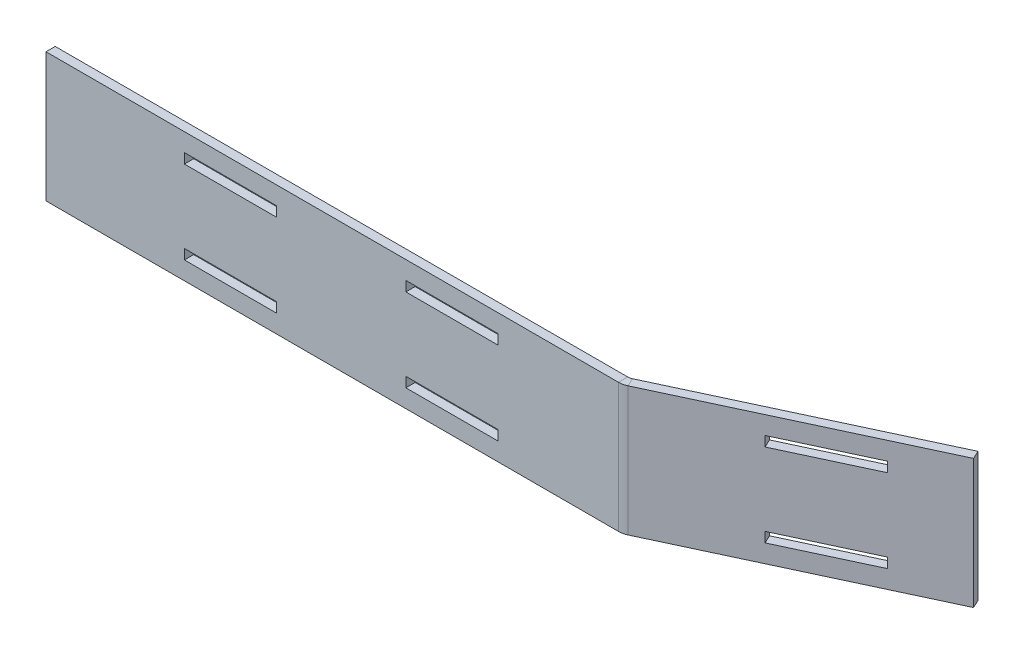
ISO-10303-21;
HEADER;
FILE_DESCRIPTION(('STEP AP214'),'2;1');
FILE_NAME('part.step','',(''),(''),'','','');
FILE_SCHEMA(('AUTOMOTIVE_DESIGN { 1 0 10303 214 1 1 1 1 }'));
ENDSEC;
DATA;
#1=APPLICATION_CONTEXT('core data for automotive mechanical design processes');
#2=APPLICATION_PROTOCOL_DEFINITION('international standard','automotive_design',2000,#1);
#3=PRODUCT_CONTEXT('',#1,'mechanical');
#4=PRODUCT('Part','Part','',(#3));
#5=PRODUCT_RELATED_PRODUCT_CATEGORY('part','',(#4));
#6=PRODUCT_DEFINITION_FORMATION('','',#4);
#7=PRODUCT_DEFINITION_CONTEXT('part definition',#1,'design');
#8=PRODUCT_DEFINITION('design','',#6,#7);
#9=PRODUCT_DEFINITION_SHAPE('','',#8);
#10=(LENGTH_UNIT() NAMED_UNIT(*) SI_UNIT(.MILLI.,.METRE.));
#11=(NAMED_UNIT(*) PLANE_ANGLE_UNIT() SI_UNIT($,.RADIAN.));
#12=(NAMED_UNIT(*) SI_UNIT($,.STERADIAN.) SOLID_ANGLE_UNIT());
#13=UNCERTAINTY_MEASURE_WITH_UNIT(LENGTH_MEASURE(1.E-05),#10,'distance_accuracy_value','');
#14=(GEOMETRIC_REPRESENTATION_CONTEXT(3) GLOBAL_UNCERTAINTY_ASSIGNED_CONTEXT((#13)) GLOBAL_UNIT_ASSIGNED_CONTEXT((#10,
#11,#12)) REPRESENTATION_CONTEXT('',''));
#15=CARTESIAN_POINT('',(0.,0.,0.));
#16=DIRECTION('',(0.,0.,1.));
#17=DIRECTION('',(1.,0.,0.));
#18=AXIS2_PLACEMENT_3D('',#15,#16,#17);
#19=CARTESIAN_POINT('',(198.332218755721,44.45,-0.297472776158614));
#20=DIRECTION('',(0.,1.,0.));
#21=DIRECTION('',(0.,0.,1.));
#22=AXIS2_PLACEMENT_3D('',#19,#20,#21);
#23=PLANE('',#22);
#24=DIRECTION('',(0.422618261740702,0.,0.906307787036649));
#25=VECTOR('',#24,1.);
#26=CARTESIAN_POINT('',(198.332218755721,44.45,-0.297472776158614));
#27=LINE('',#26,#25);
#28=CARTESIAN_POINT('',(198.332218755721,44.45,-0.297472776158614));
#29=VERTEX_POINT('',#28);
#30=CARTESIAN_POINT('',(199.674031736748,44.45,2.58005444768275));
#31=VERTEX_POINT('',#30);
#32=EDGE_CURVE('E11',#29,#31,#27,.T.);
#33=ORIENTED_EDGE('',*,*,#32,.F.);
#34=CARTESIAN_POINT('',(196.990405774695,44.45,-3.17499999999999));
#35=DIRECTION('',(0.,-1.,0.));
#36=DIRECTION('',(0.,0.,-1.));
#37=AXIS2_PLACEMENT_3D('',#34,#35,#36);
#38=CIRCLE('',#37,3.175);
#39=CARTESIAN_POINT('',(196.990405774695,44.45,0.));
#40=VERTEX_POINT('',#39);
#41=EDGE_CURVE('E490',#40,#29,#38,.F.);
#42=ORIENTED_EDGE('',*,*,#41,.F.);
#43=DIRECTION('',(0.,0.,-1.));
#44=VECTOR('',#43,1.);
#45=CARTESIAN_POINT('',(196.990405774695,44.45,3.17500000000001));
#46=LINE('',#45,#44);
#47=CARTESIAN_POINT('',(196.990405774695,44.45,3.17500000000001));
#48=VERTEX_POINT('',#47);
#49=EDGE_CURVE('E53',#48,#40,#46,.T.);
#50=ORIENTED_EDGE('',*,*,#49,.F.);
#51=CARTESIAN_POINT('',(196.990405774695,44.45,-3.17499999999999));
#52=DIRECTION('',(0.,1.,0.));
#53=DIRECTION('',(1.,0.,0.));
#54=AXIS2_PLACEMENT_3D('',#51,#52,#53);
#55=CIRCLE('',#54,6.35);
#56=EDGE_CURVE('E505',#48,#31,#55,.T.);
#57=ORIENTED_EDGE('',*,*,#56,.T.);
#58=EDGE_LOOP('',(#33,#42,#50,#57));
#59=FACE_BOUND('',#58,.T.);
#60=ADVANCED_FACE('F46',(#59),#23,.T.);
#61=CARTESIAN_POINT('',(196.990405774695,44.45,3.17500000000001));
#62=DIRECTION('',(0.,1.,0.));
#63=DIRECTION('',(0.,0.,1.));
#64=AXIS2_PLACEMENT_3D('',#61,#62,#63);
#65=PLANE('',#64);
#66=DIRECTION('',(0.906307787036649,0.,-0.422618261740701));
#67=VECTOR('',#66,1.);
#68=CARTESIAN_POINT('',(197.694286328586,44.45,0.));
#69=LINE('',#68,#67);
#70=CARTESIAN_POINT('',(279.4,44.45,-38.1));
#71=VERTEX_POINT('',#70);
#72=EDGE_CURVE('E487',#29,#71,#69,.T.);
#73=ORIENTED_EDGE('',*,*,#72,.F.);
#74=ORIENTED_EDGE('',*,*,#32,.T.);
#75=DIRECTION('',(0.906307787036649,0.,-0.422618261740701));
#76=VECTOR('',#75,1.);
#77=CARTESIAN_POINT('',(199.036099309613,44.45,2.87752722384136));
#78=LINE('',#77,#76);
#79=CARTESIAN_POINT('',(280.741812981027,44.45,-35.2224727761587));
#80=VERTEX_POINT('',#79);
#81=EDGE_CURVE('E481',#31,#80,#78,.T.);
#82=ORIENTED_EDGE('',*,*,#81,.T.);
#83=DIRECTION('',(0.422618261740711,0.,0.906307787036644));
#84=VECTOR('',#83,1.);
#85=CARTESIAN_POINT('',(279.4,44.45,-38.1));
#86=LINE('',#85,#84);
#87=EDGE_CURVE('E483',#71,#80,#86,.T.);
#88=ORIENTED_EDGE('',*,*,#87,.F.);
#89=EDGE_LOOP('',(#73,#74,#82,#88));
#90=FACE_BOUND('',#89,.T.);
#91=ADVANCED_FACE('F592',(#90),#65,.T.);
#92=CARTESIAN_POINT('',(196.990405774695,0.,0.));
#93=DIRECTION('',(0.,-1.,0.));
#94=DIRECTION('',(0.,0.,-1.));
#95=AXIS2_PLACEMENT_3D('',#92,#93,#94);
#96=PLANE('',#95);
#97=DIRECTION('',(0.,0.,1.));
#98=VECTOR('',#97,1.);
#99=CARTESIAN_POINT('',(196.990405774695,0.,0.));
#100=LINE('',#99,#98);
#101=CARTESIAN_POINT('',(196.990405774695,0.,0.));
#102=VERTEX_POINT('',#101);
#103=CARTESIAN_POINT('',(196.990405774695,0.,3.17500000000001));
#104=VERTEX_POINT('',#103);
#105=EDGE_CURVE('E556',#102,#104,#100,.T.);
#106=ORIENTED_EDGE('',*,*,#105,.F.);
#107=CARTESIAN_POINT('',(196.990405774695,0.,-3.17499999999999));
#108=DIRECTION('',(0.,-1.,0.));
#109=DIRECTION('',(0.,0.,-1.));
#110=AXIS2_PLACEMENT_3D('',#107,#108,#109);
#111=CIRCLE('',#110,3.175);
#112=CARTESIAN_POINT('',(198.332218755721,0.,-0.297472776158614));
#113=VERTEX_POINT('',#112);
#114=EDGE_CURVE('E517',#102,#113,#111,.F.);
#115=ORIENTED_EDGE('',*,*,#114,.T.);
#116=DIRECTION('',(-0.422618261740702,0.,-0.906307787036649));
#117=VECTOR('',#116,1.);
#118=CARTESIAN_POINT('',(199.674031736748,0.,2.58005444768275));
#119=LINE('',#118,#117);
#120=CARTESIAN_POINT('',(199.674031736748,0.,2.58005444768275));
#121=VERTEX_POINT('',#120);
#122=EDGE_CURVE('E554',#121,#113,#119,.T.);
#123=ORIENTED_EDGE('',*,*,#122,.F.);
#124=CARTESIAN_POINT('',(196.990405774695,0.,-3.17499999999999));
#125=DIRECTION('',(0.,1.,0.));
#126=DIRECTION('',(1.,0.,0.));
#127=AXIS2_PLACEMENT_3D('',#124,#125,#126);
#128=CIRCLE('',#127,6.35);
#129=EDGE_CURVE('E484',#104,#121,#128,.T.);
#130=ORIENTED_EDGE('',*,*,#129,.F.);
#131=EDGE_LOOP('',(#106,#115,#123,#130));
#132=FACE_BOUND('',#131,.T.);
#133=ADVANCED_FACE('F598',(#132),#96,.T.);
#134=CARTESIAN_POINT('',(199.674031736748,0.,2.58005444768275));
#135=DIRECTION('',(0.,-1.,0.));
#136=DIRECTION('',(0.,0.,-1.));
#137=AXIS2_PLACEMENT_3D('',#134,#135,#136);
#138=PLANE('',#137);
#139=DIRECTION('',(1.,0.,0.));
#140=VECTOR('',#139,1.);
#141=CARTESIAN_POINT('',(0.,0.,0.));
#142=LINE('',#141,#140);
#143=CARTESIAN_POINT('',(0.,0.,0.));
#144=VERTEX_POINT('',#143);
#145=EDGE_CURVE('E520',#144,#102,#142,.T.);
#146=ORIENTED_EDGE('',*,*,#145,.T.);
#147=ORIENTED_EDGE('',*,*,#105,.T.);
#148=DIRECTION('',(1.,0.,0.));
#149=VECTOR('',#148,1.);
#150=CARTESIAN_POINT('',(0.,0.,3.175));
#151=LINE('',#150,#149);
#152=CARTESIAN_POINT('',(0.,0.,3.175));
#153=VERTEX_POINT('',#152);
#154=EDGE_CURVE('E527',#153,#104,#151,.T.);
#155=ORIENTED_EDGE('',*,*,#154,.F.);
#156=DIRECTION('',(0.,0.,-1.));
#157=VECTOR('',#156,1.);
#158=CARTESIAN_POINT('',(0.,0.,3.175));
#159=LINE('',#158,#157);
#160=EDGE_CURVE('E524',#153,#144,#159,.T.);
#161=ORIENTED_EDGE('',*,*,#160,.T.);
#162=EDGE_LOOP('',(#146,#147,#155,#161));
#163=FACE_BOUND('',#162,.T.);
#164=ADVANCED_FACE('F600',(#163),#138,.T.);
#165=CARTESIAN_POINT('',(199.036099309613,44.45,2.87752722384136));
#166=DIRECTION('',(-0.422618261740701,0.,-0.906307787036649));
#167=DIRECTION('',(-0.906307787036649,0.,0.422618261740701));
#168=AXIS2_PLACEMENT_3D('',#165,#166,#167);
#169=PLANE('',#168);
#170=DIRECTION('',(-0.906307787036649,0.,0.422618261740701));
#171=VECTOR('',#170,1.);
#172=CARTESIAN_POINT('',(199.036099309613,34.798,2.87752722384136));
#173=LINE('',#172,#171);
#174=CARTESIAN_POINT('',(260.599122414137,34.798,-25.8297819089716));
#175=VERTEX_POINT('',#174);
#176=CARTESIAN_POINT('',(231.823850175724,34.798,-12.4116520987043));
#177=VERTEX_POINT('',#176);
#178=EDGE_CURVE('E329',#175,#177,#173,.T.);
#179=ORIENTED_EDGE('',*,*,#178,.T.);
#180=DIRECTION('',(0.,1.,0.));
#181=VECTOR('',#180,1.);
#182=CARTESIAN_POINT('',(231.823850175724,44.45,-12.4116520987043));
#183=LINE('',#182,#181);
#184=CARTESIAN_POINT('',(231.823850175724,38.227,-12.4116520987043));
#185=VERTEX_POINT('',#184);
#186=EDGE_CURVE('E332',#177,#185,#183,.T.);
#187=ORIENTED_EDGE('',*,*,#186,.T.);
#188=DIRECTION('',(0.906307787036649,0.,-0.422618261740701));
#189=VECTOR('',#188,1.);
#190=CARTESIAN_POINT('',(199.036099309613,38.227,2.87752722384136));
#191=LINE('',#190,#189);
#192=CARTESIAN_POINT('',(260.599122414137,38.227,-25.8297819089716));
#193=VERTEX_POINT('',#192);
#194=EDGE_CURVE('E326',#185,#193,#191,.T.);
#195=ORIENTED_EDGE('',*,*,#194,.T.);
#196=DIRECTION('',(0.,-1.,0.));
#197=VECTOR('',#196,1.);
#198=CARTESIAN_POINT('',(260.599122414137,44.4500000000001,-25.8297819089716));
#199=LINE('',#198,#197);
#200=EDGE_CURVE('E270',#193,#175,#199,.T.);
#201=ORIENTED_EDGE('',*,*,#200,.T.);
#202=EDGE_LOOP('',(#179,#187,#195,#201));
#203=FACE_BOUND('',#202,.T.);
#204=DIRECTION('',(0.906307787036649,0.,-0.422618261740701));
#205=VECTOR('',#204,1.);
#206=CARTESIAN_POINT('',(199.036099309613,9.652,2.87752722384136));
#207=LINE('',#206,#205);
#208=CARTESIAN_POINT('',(231.823850175724,9.652,-12.4116520987044));
#209=VERTEX_POINT('',#208);
#210=CARTESIAN_POINT('',(260.599122414137,9.652,-25.8297819089716));
#211=VERTEX_POINT('',#210);
#212=EDGE_CURVE('E320',#209,#211,#207,.T.);
#213=ORIENTED_EDGE('',*,*,#212,.T.);
#214=DIRECTION('',(0.,-1.,0.));
#215=VECTOR('',#214,1.);
#216=CARTESIAN_POINT('',(260.599122414137,44.4499999999999,-25.8297819089716));
#217=LINE('',#216,#215);
#218=CARTESIAN_POINT('',(260.599122414137,6.223,-25.8297819089716));
#219=VERTEX_POINT('',#218);
#220=EDGE_CURVE('E323',#211,#219,#217,.T.);
#221=ORIENTED_EDGE('',*,*,#220,.T.);
#222=DIRECTION('',(-0.906307787036649,0.,0.422618261740701));
#223=VECTOR('',#222,1.);
#224=CARTESIAN_POINT('',(199.036099309613,6.223,2.87752722384136));
#225=LINE('',#224,#223);
#226=CARTESIAN_POINT('',(231.823850175724,6.223,-12.4116520987043));
#227=VERTEX_POINT('',#226);
#228=EDGE_CURVE('E294',#219,#227,#225,.T.);
#229=ORIENTED_EDGE('',*,*,#228,.T.);
#230=DIRECTION('',(0.,1.,0.));
#231=VECTOR('',#230,1.);
#232=CARTESIAN_POINT('',(231.823850175724,44.45,-12.4116520987043));
#233=LINE('',#232,#231);
#234=EDGE_CURVE('E317',#227,#209,#233,.T.);
#235=ORIENTED_EDGE('',*,*,#234,.T.);
#236=EDGE_LOOP('',(#213,#221,#229,#235));
#237=FACE_BOUND('',#236,.T.);
#238=DIRECTION('',(0.906307787036649,0.,-0.422618261740701));
#239=VECTOR('',#238,1.);
#240=CARTESIAN_POINT('',(199.036099309613,0.,2.87752722384136));
#241=LINE('',#240,#239);
#242=CARTESIAN_POINT('',(280.741812981027,0.,-35.2224727761587));
#243=VERTEX_POINT('',#242);
#244=EDGE_CURVE('E474',#121,#243,#241,.T.);
#245=ORIENTED_EDGE('',*,*,#244,.T.);
#246=DIRECTION('',(0.,-1.,0.));
#247=VECTOR('',#246,1.);
#248=CARTESIAN_POINT('',(280.741812981027,44.45,-35.2224727761587));
#249=LINE('',#248,#247);
#250=EDGE_CURVE('E552',#80,#243,#249,.T.);
#251=ORIENTED_EDGE('',*,*,#250,.F.);
#252=ORIENTED_EDGE('',*,*,#81,.F.);
#253=DIRECTION('',(0.,-1.,0.));
#254=VECTOR('',#253,1.);
#255=CARTESIAN_POINT('',(199.674031736748,44.45,2.58005444768275));
#256=LINE('',#255,#254);
#257=EDGE_CURVE('E508',#31,#121,#256,.T.);
#258=ORIENTED_EDGE('',*,*,#257,.T.);
#259=EDGE_LOOP('',(#245,#251,#252,#258));
#260=FACE_BOUND('',#259,.T.);
#261=ADVANCED_FACE('F588',(#203,#237,#260),#169,.F.);
#262=CARTESIAN_POINT('',(279.4,44.45,-38.1));
#263=DIRECTION('',(0.906307787036644,0.,-0.422618261740711));
#264=DIRECTION('',(-0.422618261740711,0.,-0.906307787036645));
#265=AXIS2_PLACEMENT_3D('',#262,#263,#264);
#266=PLANE('',#265);
#267=DIRECTION('',(0.422618261740711,0.,0.906307787036644));
#268=VECTOR('',#267,1.);
#269=CARTESIAN_POINT('',(279.4,0.,-38.1));
#270=LINE('',#269,#268);
#271=CARTESIAN_POINT('',(279.4,0.,-38.1));
#272=VERTEX_POINT('',#271);
#273=EDGE_CURVE('E511',#272,#243,#270,.T.);
#274=ORIENTED_EDGE('',*,*,#273,.F.);
#275=DIRECTION('',(0.,-1.,0.));
#276=VECTOR('',#275,1.);
#277=CARTESIAN_POINT('',(279.4,44.45,-38.1));
#278=LINE('',#277,#276);
#279=EDGE_CURVE('E550',#71,#272,#278,.T.);
#280=ORIENTED_EDGE('',*,*,#279,.F.);
#281=ORIENTED_EDGE('',*,*,#87,.T.);
#282=ORIENTED_EDGE('',*,*,#250,.T.);
#283=EDGE_LOOP('',(#274,#280,#281,#282));
#284=FACE_BOUND('',#283,.T.);
#285=ADVANCED_FACE('F608',(#284),#266,.T.);
#286=CARTESIAN_POINT('',(197.694286328586,44.45,0.));
#287=DIRECTION('',(-0.422618261740701,0.,-0.906307787036649));
#288=DIRECTION('',(-0.906307787036649,0.,0.422618261740701));
#289=AXIS2_PLACEMENT_3D('',#286,#287,#288);
#290=PLANE('',#289);
#291=DIRECTION('',(0.,1.,0.));
#292=VECTOR('',#291,1.);
#293=CARTESIAN_POINT('',(230.482037194697,38.227,-15.2891793225457));
#294=LINE('',#293,#292);
#295=CARTESIAN_POINT('',(230.482037194697,34.798,-15.2891793225457));
#296=VERTEX_POINT('',#295);
#297=CARTESIAN_POINT('',(230.482037194697,38.227,-15.2891793225457));
#298=VERTEX_POINT('',#297);
#299=EDGE_CURVE('E282',#296,#298,#294,.T.);
#300=ORIENTED_EDGE('',*,*,#299,.F.);
#301=DIRECTION('',(-0.906307787036649,0.,0.422618261740701));
#302=VECTOR('',#301,1.);
#303=CARTESIAN_POINT('',(259.257309433111,34.798,-28.7073091328129));
#304=LINE('',#303,#302);
#305=CARTESIAN_POINT('',(259.257309433111,34.798,-28.7073091328129));
#306=VERTEX_POINT('',#305);
#307=EDGE_CURVE('E287',#306,#296,#304,.T.);
#308=ORIENTED_EDGE('',*,*,#307,.F.);
#309=DIRECTION('',(0.,-1.,0.));
#310=VECTOR('',#309,1.);
#311=CARTESIAN_POINT('',(259.257309433111,38.227,-28.7073091328129));
#312=LINE('',#311,#310);
#313=CARTESIAN_POINT('',(259.257309433111,38.227,-28.7073091328129));
#314=VERTEX_POINT('',#313);
#315=EDGE_CURVE('E267',#314,#306,#312,.T.);
#316=ORIENTED_EDGE('',*,*,#315,.F.);
#317=DIRECTION('',(0.906307787036649,0.,-0.422618261740701));
#318=VECTOR('',#317,1.);
#319=CARTESIAN_POINT('',(259.257309433111,38.227,-28.7073091328129));
#320=LINE('',#319,#318);
#321=EDGE_CURVE('E277',#298,#314,#320,.T.);
#322=ORIENTED_EDGE('',*,*,#321,.F.);
#323=EDGE_LOOP('',(#300,#308,#316,#322));
#324=FACE_BOUND('',#323,.T.);
#325=DIRECTION('',(0.,-1.,0.));
#326=VECTOR('',#325,1.);
#327=CARTESIAN_POINT('',(259.257309433111,6.223,-28.7073091328129));
#328=LINE('',#327,#326);
#329=CARTESIAN_POINT('',(259.257309433111,9.652,-28.7073091328129));
#330=VERTEX_POINT('',#329);
#331=CARTESIAN_POINT('',(259.25730943311,6.223,-28.7073091328129));
#332=VERTEX_POINT('',#331);
#333=EDGE_CURVE('E313',#330,#332,#328,.T.);
#334=ORIENTED_EDGE('',*,*,#333,.F.);
#335=DIRECTION('',(0.906307787036649,0.,-0.422618261740701));
#336=VECTOR('',#335,1.);
#337=CARTESIAN_POINT('',(259.257309433111,9.652,-28.7073091328129));
#338=LINE('',#337,#336);
#339=CARTESIAN_POINT('',(230.482037194697,9.652,-15.2891793225457));
#340=VERTEX_POINT('',#339);
#341=EDGE_CURVE('E300',#340,#330,#338,.T.);
#342=ORIENTED_EDGE('',*,*,#341,.F.);
#343=DIRECTION('',(0.,1.,0.));
#344=VECTOR('',#343,1.);
#345=CARTESIAN_POINT('',(230.482037194697,6.223,-15.2891793225457));
#346=LINE('',#345,#344);
#347=CARTESIAN_POINT('',(230.482037194697,6.223,-15.2891793225457));
#348=VERTEX_POINT('',#347);
#349=EDGE_CURVE('E308',#348,#340,#346,.T.);
#350=ORIENTED_EDGE('',*,*,#349,.F.);
#351=DIRECTION('',(-0.906307787036649,0.,0.422618261740701));
#352=VECTOR('',#351,1.);
#353=CARTESIAN_POINT('',(259.257309433111,6.223,-28.7073091328129));
#354=LINE('',#353,#352);
#355=EDGE_CURVE('E311',#332,#348,#354,.T.);
#356=ORIENTED_EDGE('',*,*,#355,.F.);
#357=EDGE_LOOP('',(#334,#342,#350,#356));
#358=FACE_BOUND('',#357,.T.);
#359=DIRECTION('',(0.906307787036649,0.,-0.422618261740701));
#360=VECTOR('',#359,1.);
#361=CARTESIAN_POINT('',(197.694286328586,0.,0.));
#362=LINE('',#361,#360);
#363=EDGE_CURVE('E514',#113,#272,#362,.T.);
#364=ORIENTED_EDGE('',*,*,#363,.F.);
#365=DIRECTION('',(0.,-1.,0.));
#366=VECTOR('',#365,1.);
#367=CARTESIAN_POINT('',(198.332218755721,44.45,-0.297472776158614));
#368=LINE('',#367,#366);
#369=EDGE_CURVE('E547',#29,#113,#368,.T.);
#370=ORIENTED_EDGE('',*,*,#369,.F.);
#371=ORIENTED_EDGE('',*,*,#72,.T.);
#372=ORIENTED_EDGE('',*,*,#279,.T.);
#373=EDGE_LOOP('',(#364,#370,#371,#372));
#374=FACE_BOUND('',#373,.T.);
#375=ADVANCED_FACE('F284',(#324,#358,#374),#290,.T.);
#376=CARTESIAN_POINT('',(196.990405774695,44.45,-3.17499999999999));
#377=DIRECTION('',(0.,-1.,0.));
#378=DIRECTION('',(0.,0.,-1.));
#379=AXIS2_PLACEMENT_3D('',#376,#377,#378);
#380=CYLINDRICAL_SURFACE('',#379,3.175);
#381=ORIENTED_EDGE('',*,*,#114,.F.);
#382=DIRECTION('',(0.,-1.,0.));
#383=VECTOR('',#382,1.);
#384=CARTESIAN_POINT('',(196.990405774695,44.45,0.));
#385=LINE('',#384,#383);
#386=EDGE_CURVE('E544',#40,#102,#385,.T.);
#387=ORIENTED_EDGE('',*,*,#386,.F.);
#388=ORIENTED_EDGE('',*,*,#41,.T.);
#389=ORIENTED_EDGE('',*,*,#369,.T.);
#390=EDGE_LOOP('',(#381,#387,#388,#389));
#391=FACE_BOUND('',#390,.T.);
#392=ADVANCED_FACE('F568',(#391),#380,.F.);
#393=CARTESIAN_POINT('',(0.,44.45,0.));
#394=DIRECTION('',(0.,0.,-1.));
#395=DIRECTION('',(-1.,0.,0.));
#396=AXIS2_PLACEMENT_3D('',#393,#394,#395);
#397=PLANE('',#396);
#398=DIRECTION('',(-1.,0.,0.));
#399=VECTOR('',#398,1.);
#400=CARTESIAN_POINT('',(47.625,6.22300000000002,0.));
#401=LINE('',#400,#399);
#402=CARTESIAN_POINT('',(79.375,6.22300000000002,0.));
#403=VERTEX_POINT('',#402);
#404=CARTESIAN_POINT('',(47.625,6.22300000000002,0.));
#405=VERTEX_POINT('',#404);
#406=EDGE_CURVE('E380',#403,#405,#401,.T.);
#407=ORIENTED_EDGE('',*,*,#406,.F.);
#408=DIRECTION('',(0.,-1.,0.));
#409=VECTOR('',#408,1.);
#410=CARTESIAN_POINT('',(79.375,6.22300000000002,0.));
#411=LINE('',#410,#409);
#412=CARTESIAN_POINT('',(79.375,9.65200000000002,0.));
#413=VERTEX_POINT('',#412);
#414=EDGE_CURVE('E415',#413,#403,#411,.T.);
#415=ORIENTED_EDGE('',*,*,#414,.F.);
#416=DIRECTION('',(1.,0.,0.));
#417=VECTOR('',#416,1.);
#418=CARTESIAN_POINT('',(47.625,9.65200000000003,0.));
#419=LINE('',#418,#417);
#420=CARTESIAN_POINT('',(47.625,9.65200000000003,0.));
#421=VERTEX_POINT('',#420);
#422=EDGE_CURVE('E419',#421,#413,#419,.T.);
#423=ORIENTED_EDGE('',*,*,#422,.F.);
#424=DIRECTION('',(0.,1.,0.));
#425=VECTOR('',#424,1.);
#426=CARTESIAN_POINT('',(47.625,6.22300000000002,0.));
#427=LINE('',#426,#425);
#428=EDGE_CURVE('E424',#405,#421,#427,.T.);
#429=ORIENTED_EDGE('',*,*,#428,.F.);
#430=EDGE_LOOP('',(#407,#415,#423,#429));
#431=FACE_BOUND('',#430,.T.);
#432=DIRECTION('',(-1.,0.,0.));
#433=VECTOR('',#432,1.);
#434=CARTESIAN_POINT('',(123.825,6.22300000000002,0.));
#435=LINE('',#434,#433);
#436=CARTESIAN_POINT('',(155.575,6.22300000000002,0.));
#437=VERTEX_POINT('',#436);
#438=CARTESIAN_POINT('',(123.825,6.22300000000002,0.));
#439=VERTEX_POINT('',#438);
#440=EDGE_CURVE('E346',#437,#439,#435,.T.);
#441=ORIENTED_EDGE('',*,*,#440,.F.);
#442=DIRECTION('',(0.,-1.,0.));
#443=VECTOR('',#442,1.);
#444=CARTESIAN_POINT('',(155.575,6.22300000000002,0.));
#445=LINE('',#444,#443);
#446=CARTESIAN_POINT('',(155.575,9.65200000000001,0.));
#447=VERTEX_POINT('',#446);
#448=EDGE_CURVE('E381',#447,#437,#445,.T.);
#449=ORIENTED_EDGE('',*,*,#448,.F.);
#450=DIRECTION('',(1.,0.,0.));
#451=VECTOR('',#450,1.);
#452=CARTESIAN_POINT('',(123.825,9.65200000000001,0.));
#453=LINE('',#452,#451);
#454=CARTESIAN_POINT('',(123.825,9.65200000000001,0.));
#455=VERTEX_POINT('',#454);
#456=EDGE_CURVE('E384',#455,#447,#453,.T.);
#457=ORIENTED_EDGE('',*,*,#456,.F.);
#458=DIRECTION('',(0.,1.,0.));
#459=VECTOR('',#458,1.);
#460=CARTESIAN_POINT('',(123.825,6.22300000000002,0.));
#461=LINE('',#460,#459);
#462=EDGE_CURVE('E388',#439,#455,#461,.T.);
#463=ORIENTED_EDGE('',*,*,#462,.F.);
#464=EDGE_LOOP('',(#441,#449,#457,#463));
#465=FACE_BOUND('',#464,.T.);
#466=DIRECTION('',(0.,1.,0.));
#467=VECTOR('',#466,1.);
#468=CARTESIAN_POINT('',(123.825,38.227,0.));
#469=LINE('',#468,#467);
#470=CARTESIAN_POINT('',(123.825,34.798,0.));
#471=VERTEX_POINT('',#470);
#472=CARTESIAN_POINT('',(123.825,38.227,0.));
#473=VERTEX_POINT('',#472);
#474=EDGE_CURVE('E357',#471,#473,#469,.T.);
#475=ORIENTED_EDGE('',*,*,#474,.F.);
#476=DIRECTION('',(-1.,0.,0.));
#477=VECTOR('',#476,1.);
#478=CARTESIAN_POINT('',(123.825,34.798,0.));
#479=LINE('',#478,#477);
#480=CARTESIAN_POINT('',(155.575,34.798,0.));
#481=VERTEX_POINT('',#480);
#482=EDGE_CURVE('E347',#481,#471,#479,.T.);
#483=ORIENTED_EDGE('',*,*,#482,.F.);
#484=DIRECTION('',(0.,-1.,0.));
#485=VECTOR('',#484,1.);
#486=CARTESIAN_POINT('',(155.575,38.227,0.));
#487=LINE('',#486,#485);
#488=CARTESIAN_POINT('',(155.575,38.227,0.));
#489=VERTEX_POINT('',#488);
#490=EDGE_CURVE('E350',#489,#481,#487,.T.);
#491=ORIENTED_EDGE('',*,*,#490,.F.);
#492=DIRECTION('',(1.,0.,0.));
#493=VECTOR('',#492,1.);
#494=CARTESIAN_POINT('',(123.825,38.227,0.));
#495=LINE('',#494,#493);
#496=EDGE_CURVE('E354',#473,#489,#495,.T.);
#497=ORIENTED_EDGE('',*,*,#496,.F.);
#498=EDGE_LOOP('',(#475,#483,#491,#497));
#499=FACE_BOUND('',#498,.T.);
#500=DIRECTION('',(0.,1.,0.));
#501=VECTOR('',#500,1.);
#502=CARTESIAN_POINT('',(47.625,38.227,0.));
#503=LINE('',#502,#501);
#504=CARTESIAN_POINT('',(47.625,34.798,0.));
#505=VERTEX_POINT('',#504);
#506=CARTESIAN_POINT('',(47.625,38.227,0.));
#507=VERTEX_POINT('',#506);
#508=EDGE_CURVE('E359',#505,#507,#503,.T.);
#509=ORIENTED_EDGE('',*,*,#508,.F.);
#510=DIRECTION('',(-1.,0.,0.));
#511=VECTOR('',#510,1.);
#512=CARTESIAN_POINT('',(47.625,34.798,0.));
#513=LINE('',#512,#511);
#514=CARTESIAN_POINT('',(79.375,34.798,0.));
#515=VERTEX_POINT('',#514);
#516=EDGE_CURVE('E449',#515,#505,#513,.T.);
#517=ORIENTED_EDGE('',*,*,#516,.F.);
#518=DIRECTION('',(0.,-1.,0.));
#519=VECTOR('',#518,1.);
#520=CARTESIAN_POINT('',(79.375,38.227,0.));
#521=LINE('',#520,#519);
#522=CARTESIAN_POINT('',(79.375,38.227,0.));
#523=VERTEX_POINT('',#522);
#524=EDGE_CURVE('E465',#523,#515,#521,.T.);
#525=ORIENTED_EDGE('',*,*,#524,.F.);
#526=DIRECTION('',(1.,0.,0.));
#527=VECTOR('',#526,1.);
#528=CARTESIAN_POINT('',(47.625,38.227,0.));
#529=LINE('',#528,#527);
#530=EDGE_CURVE('E462',#507,#523,#529,.T.);
#531=ORIENTED_EDGE('',*,*,#530,.F.);
#532=EDGE_LOOP('',(#509,#517,#525,#531));
#533=FACE_BOUND('',#532,.T.);
#534=ORIENTED_EDGE('',*,*,#145,.F.);
#535=DIRECTION('',(0.,-1.,0.));
#536=VECTOR('',#535,1.);
#537=CARTESIAN_POINT('',(0.,44.45,0.));
#538=LINE('',#537,#536);
#539=CARTESIAN_POINT('',(0.,44.45,0.));
#540=VERTEX_POINT('',#539);
#541=EDGE_CURVE('E541',#540,#144,#538,.T.);
#542=ORIENTED_EDGE('',*,*,#541,.F.);
#543=DIRECTION('',(1.,0.,0.));
#544=VECTOR('',#543,1.);
#545=CARTESIAN_POINT('',(0.,44.45,0.));
#546=LINE('',#545,#544);
#547=EDGE_CURVE('E493',#540,#40,#546,.T.);
#548=ORIENTED_EDGE('',*,*,#547,.T.);
#549=ORIENTED_EDGE('',*,*,#386,.T.);
#550=EDGE_LOOP('',(#534,#542,#548,#549));
#551=FACE_BOUND('',#550,.T.);
#552=ADVANCED_FACE('F572',(#431,#465,#499,#533,#551),#397,.T.);
#553=CARTESIAN_POINT('',(0.,44.45,3.175));
#554=DIRECTION('',(-1.,0.,0.));
#555=DIRECTION('',(0.,0.,1.));
#556=AXIS2_PLACEMENT_3D('',#553,#554,#555);
#557=PLANE('',#556);
#558=ORIENTED_EDGE('',*,*,#160,.F.);
#559=DIRECTION('',(0.,-1.,0.));
#560=VECTOR('',#559,1.);
#561=CARTESIAN_POINT('',(0.,44.45,3.175));
#562=LINE('',#561,#560);
#563=CARTESIAN_POINT('',(0.,44.45,3.175));
#564=VERTEX_POINT('',#563);
#565=EDGE_CURVE('E538',#564,#153,#562,.T.);
#566=ORIENTED_EDGE('',*,*,#565,.F.);
#567=DIRECTION('',(0.,0.,-1.));
#568=VECTOR('',#567,1.);
#569=CARTESIAN_POINT('',(0.,44.45,3.175));
#570=LINE('',#569,#568);
#571=EDGE_CURVE('E497',#564,#540,#570,.T.);
#572=ORIENTED_EDGE('',*,*,#571,.T.);
#573=ORIENTED_EDGE('',*,*,#541,.T.);
#574=EDGE_LOOP('',(#558,#566,#572,#573));
#575=FACE_BOUND('',#574,.T.);
#576=ADVANCED_FACE('F575',(#575),#557,.T.);
#577=CARTESIAN_POINT('',(0.,44.45,3.175));
#578=DIRECTION('',(0.,0.,-1.));
#579=DIRECTION('',(-1.,0.,0.));
#580=AXIS2_PLACEMENT_3D('',#577,#578,#579);
#581=PLANE('',#580);
#582=DIRECTION('',(0.,-1.,0.));
#583=VECTOR('',#582,1.);
#584=CARTESIAN_POINT('',(79.375,6.22300000000002,3.17500000000001));
#585=LINE('',#584,#583);
#586=CARTESIAN_POINT('',(79.375,9.65200000000002,3.17500000000001));
#587=VERTEX_POINT('',#586);
#588=CARTESIAN_POINT('',(79.375,6.22300000000002,3.17500000000001));
#589=VERTEX_POINT('',#588);
#590=EDGE_CURVE('E406',#587,#589,#585,.T.);
#591=ORIENTED_EDGE('',*,*,#590,.T.);
#592=DIRECTION('',(-1.,0.,0.));
#593=VECTOR('',#592,1.);
#594=CARTESIAN_POINT('',(47.625,6.22300000000002,3.17500000000001));
#595=LINE('',#594,#593);
#596=CARTESIAN_POINT('',(47.625,6.22300000000002,3.17500000000001));
#597=VERTEX_POINT('',#596);
#598=EDGE_CURVE('E420',#589,#597,#595,.T.);
#599=ORIENTED_EDGE('',*,*,#598,.T.);
#600=DIRECTION('',(0.,1.,0.));
#601=VECTOR('',#600,1.);
#602=CARTESIAN_POINT('',(47.625,6.22300000000002,3.17500000000001));
#603=LINE('',#602,#601);
#604=CARTESIAN_POINT('',(47.625,9.65200000000002,3.175));
#605=VERTEX_POINT('',#604);
#606=EDGE_CURVE('E437',#597,#605,#603,.T.);
#607=ORIENTED_EDGE('',*,*,#606,.T.);
#608=DIRECTION('',(1.,0.,0.));
#609=VECTOR('',#608,1.);
#610=CARTESIAN_POINT('',(47.625,9.65200000000003,3.17500000000001));
#611=LINE('',#610,#609);
#612=EDGE_CURVE('E433',#605,#587,#611,.T.);
#613=ORIENTED_EDGE('',*,*,#612,.T.);
#614=EDGE_LOOP('',(#591,#599,#607,#613));
#615=FACE_BOUND('',#614,.T.);
#616=DIRECTION('',(0.,-1.,0.));
#617=VECTOR('',#616,1.);
#618=CARTESIAN_POINT('',(155.575,6.22300000000002,3.17500000000001));
#619=LINE('',#618,#617);
#620=CARTESIAN_POINT('',(155.575,9.65200000000001,3.17500000000001));
#621=VERTEX_POINT('',#620);
#622=CARTESIAN_POINT('',(155.575,6.22300000000002,3.17500000000001));
#623=VERTEX_POINT('',#622);
#624=EDGE_CURVE('E373',#621,#623,#619,.T.);
#625=ORIENTED_EDGE('',*,*,#624,.T.);
#626=DIRECTION('',(-1.,0.,0.));
#627=VECTOR('',#626,1.);
#628=CARTESIAN_POINT('',(123.825,6.22300000000002,3.17500000000001));
#629=LINE('',#628,#627);
#630=CARTESIAN_POINT('',(123.825,6.22300000000002,3.17500000000001));
#631=VERTEX_POINT('',#630);
#632=EDGE_CURVE('E385',#623,#631,#629,.T.);
#633=ORIENTED_EDGE('',*,*,#632,.T.);
#634=DIRECTION('',(0.,1.,0.));
#635=VECTOR('',#634,1.);
#636=CARTESIAN_POINT('',(123.825,6.22300000000002,3.17500000000001));
#637=LINE('',#636,#635);
#638=CARTESIAN_POINT('',(123.825,9.65200000000001,3.175));
#639=VERTEX_POINT('',#638);
#640=EDGE_CURVE('E397',#631,#639,#637,.T.);
#641=ORIENTED_EDGE('',*,*,#640,.T.);
#642=DIRECTION('',(1.,0.,0.));
#643=VECTOR('',#642,1.);
#644=CARTESIAN_POINT('',(123.825,9.65200000000001,3.17500000000001));
#645=LINE('',#644,#643);
#646=EDGE_CURVE('E394',#639,#621,#645,.T.);
#647=ORIENTED_EDGE('',*,*,#646,.T.);
#648=EDGE_LOOP('',(#625,#633,#641,#647));
#649=FACE_BOUND('',#648,.T.);
#650=DIRECTION('',(-1.,0.,0.));
#651=VECTOR('',#650,1.);
#652=CARTESIAN_POINT('',(123.825,34.798,3.17500000000001));
#653=LINE('',#652,#651);
#654=CARTESIAN_POINT('',(155.575,34.798,3.17500000000001));
#655=VERTEX_POINT('',#654);
#656=CARTESIAN_POINT('',(123.825,34.798,3.17500000000001));
#657=VERTEX_POINT('',#656);
#658=EDGE_CURVE('E339',#655,#657,#653,.T.);
#659=ORIENTED_EDGE('',*,*,#658,.T.);
#660=DIRECTION('',(0.,1.,0.));
#661=VECTOR('',#660,1.);
#662=CARTESIAN_POINT('',(123.825,38.227,3.17500000000001));
#663=LINE('',#662,#661);
#664=CARTESIAN_POINT('',(123.825,38.227,3.17500000000001));
#665=VERTEX_POINT('',#664);
#666=EDGE_CURVE('E351',#657,#665,#663,.T.);
#667=ORIENTED_EDGE('',*,*,#666,.T.);
#668=DIRECTION('',(1.,0.,0.));
#669=VECTOR('',#668,1.);
#670=CARTESIAN_POINT('',(123.825,38.227,3.17500000000001));
#671=LINE('',#670,#669);
#672=CARTESIAN_POINT('',(155.575,38.227,3.175));
#673=VERTEX_POINT('',#672);
#674=EDGE_CURVE('E365',#665,#673,#671,.T.);
#675=ORIENTED_EDGE('',*,*,#674,.T.);
#676=DIRECTION('',(0.,-1.,0.));
#677=VECTOR('',#676,1.);
#678=CARTESIAN_POINT('',(155.575,38.227,3.17500000000001));
#679=LINE('',#678,#677);
#680=EDGE_CURVE('E362',#673,#655,#679,.T.);
#681=ORIENTED_EDGE('',*,*,#680,.T.);
#682=EDGE_LOOP('',(#659,#667,#675,#681));
#683=FACE_BOUND('',#682,.T.);
#684=DIRECTION('',(-1.,0.,0.));
#685=VECTOR('',#684,1.);
#686=CARTESIAN_POINT('',(47.625,34.798,3.17500000000001));
#687=LINE('',#686,#685);
#688=CARTESIAN_POINT('',(79.375,34.798,3.17500000000001));
#689=VERTEX_POINT('',#688);
#690=CARTESIAN_POINT('',(47.625,34.798,3.17500000000001));
#691=VERTEX_POINT('',#690);
#692=EDGE_CURVE('E455',#689,#691,#687,.T.);
#693=ORIENTED_EDGE('',*,*,#692,.T.);
#694=DIRECTION('',(0.,1.,0.));
#695=VECTOR('',#694,1.);
#696=CARTESIAN_POINT('',(47.625,38.227,3.17500000000001));
#697=LINE('',#696,#695);
#698=CARTESIAN_POINT('',(47.625,38.227,3.17500000000001));
#699=VERTEX_POINT('',#698);
#700=EDGE_CURVE('E444',#691,#699,#697,.T.);
#701=ORIENTED_EDGE('',*,*,#700,.T.);
#702=DIRECTION('',(1.,0.,0.));
#703=VECTOR('',#702,1.);
#704=CARTESIAN_POINT('',(47.625,38.227,3.17500000000001));
#705=LINE('',#704,#703);
#706=CARTESIAN_POINT('',(79.375,38.227,3.175));
#707=VERTEX_POINT('',#706);
#708=EDGE_CURVE('E448',#699,#707,#705,.T.);
#709=ORIENTED_EDGE('',*,*,#708,.T.);
#710=DIRECTION('',(0.,-1.,0.));
#711=VECTOR('',#710,1.);
#712=CARTESIAN_POINT('',(79.375,38.227,3.17500000000001));
#713=LINE('',#712,#711);
#714=EDGE_CURVE('E452',#707,#689,#713,.T.);
#715=ORIENTED_EDGE('',*,*,#714,.T.);
#716=EDGE_LOOP('',(#693,#701,#709,#715));
#717=FACE_BOUND('',#716,.T.);
#718=ORIENTED_EDGE('',*,*,#154,.T.);
#719=DIRECTION('',(0.,-1.,0.));
#720=VECTOR('',#719,1.);
#721=CARTESIAN_POINT('',(196.990405774695,44.45,3.17500000000001));
#722=LINE('',#721,#720);
#723=EDGE_CURVE('E535',#48,#104,#722,.T.);
#724=ORIENTED_EDGE('',*,*,#723,.F.);
#725=DIRECTION('',(1.,0.,0.));
#726=VECTOR('',#725,1.);
#727=CARTESIAN_POINT('',(0.,44.45,3.175));
#728=LINE('',#727,#726);
#729=EDGE_CURVE('E501',#564,#48,#728,.T.);
#730=ORIENTED_EDGE('',*,*,#729,.F.);
#731=ORIENTED_EDGE('',*,*,#565,.T.);
#732=EDGE_LOOP('',(#718,#724,#730,#731));
#733=FACE_BOUND('',#732,.T.);
#734=ADVANCED_FACE('F578',(#615,#649,#683,#717,#733),#581,.F.);
#735=CARTESIAN_POINT('',(196.990405774695,44.45,-3.17499999999999));
#736=DIRECTION('',(0.,-1.,0.));
#737=DIRECTION('',(0.,0.,-1.));
#738=AXIS2_PLACEMENT_3D('',#735,#736,#737);
#739=CYLINDRICAL_SURFACE('',#738,6.35);
#740=ORIENTED_EDGE('',*,*,#129,.T.);
#741=ORIENTED_EDGE('',*,*,#257,.F.);
#742=ORIENTED_EDGE('',*,*,#56,.F.);
#743=ORIENTED_EDGE('',*,*,#723,.T.);
#744=EDGE_LOOP('',(#740,#741,#742,#743));
#745=FACE_BOUND('',#744,.T.);
#746=ADVANCED_FACE('F583',(#745),#739,.T.);
#747=CARTESIAN_POINT('',(196.990405774695,44.45,-3.17499999999999));
#748=DIRECTION('',(0.,-1.,0.));
#749=DIRECTION('',(-1.,0.,0.));
#750=AXIS2_PLACEMENT_3D('',#747,#748,#749);
#751=PLANE('',#750);
#752=ORIENTED_EDGE('',*,*,#729,.T.);
#753=ORIENTED_EDGE('',*,*,#49,.T.);
#754=ORIENTED_EDGE('',*,*,#547,.F.);
#755=ORIENTED_EDGE('',*,*,#571,.F.);
#756=EDGE_LOOP('',(#752,#753,#754,#755));
#757=FACE_BOUND('',#756,.T.);
#758=ADVANCED_FACE('F560',(#757),#751,.F.);
#759=CARTESIAN_POINT('',(196.990405774695,0.,-3.17499999999999));
#760=DIRECTION('',(0.,-1.,0.));
#761=DIRECTION('',(-1.,0.,0.));
#762=AXIS2_PLACEMENT_3D('',#759,#760,#761);
#763=PLANE('',#762);
#764=ORIENTED_EDGE('',*,*,#244,.F.);
#765=ORIENTED_EDGE('',*,*,#122,.T.);
#766=ORIENTED_EDGE('',*,*,#363,.T.);
#767=ORIENTED_EDGE('',*,*,#273,.T.);
#768=EDGE_LOOP('',(#764,#765,#766,#767));
#769=FACE_BOUND('',#768,.T.);
#770=ADVANCED_FACE('F718',(#769),#763,.T.);
#771=CARTESIAN_POINT('',(47.625,38.227,3.17500000000001));
#772=DIRECTION('',(-1.,0.,0.));
#773=DIRECTION('',(0.,0.,1.));
#774=AXIS2_PLACEMENT_3D('',#771,#772,#773);
#775=PLANE('',#774);
#776=ORIENTED_EDGE('',*,*,#508,.T.);
#777=DIRECTION('',(0.,0.,-1.));
#778=VECTOR('',#777,1.);
#779=CARTESIAN_POINT('',(47.625,38.227,3.17500000000001));
#780=LINE('',#779,#778);
#781=EDGE_CURVE('E459',#699,#507,#780,.T.);
#782=ORIENTED_EDGE('',*,*,#781,.F.);
#783=ORIENTED_EDGE('',*,*,#700,.F.);
#784=DIRECTION('',(0.,0.,-1.));
#785=VECTOR('',#784,1.);
#786=CARTESIAN_POINT('',(47.625,34.798,3.17500000000001));
#787=LINE('',#786,#785);
#788=EDGE_CURVE('E471',#691,#505,#787,.T.);
#789=ORIENTED_EDGE('',*,*,#788,.T.);
#790=EDGE_LOOP('',(#776,#782,#783,#789));
#791=FACE_BOUND('',#790,.T.);
#792=ADVANCED_FACE('F727',(#791),#775,.F.);
#793=CARTESIAN_POINT('',(47.625,34.798,3.17500000000001));
#794=DIRECTION('',(0.,-1.,0.));
#795=DIRECTION('',(0.,0.,-1.));
#796=AXIS2_PLACEMENT_3D('',#793,#794,#795);
#797=PLANE('',#796);
#798=ORIENTED_EDGE('',*,*,#516,.T.);
#799=ORIENTED_EDGE('',*,*,#788,.F.);
#800=ORIENTED_EDGE('',*,*,#692,.F.);
#801=DIRECTION('',(0.,0.,-1.));
#802=VECTOR('',#801,1.);
#803=CARTESIAN_POINT('',(79.375,34.798,3.17500000000001));
#804=LINE('',#803,#802);
#805=EDGE_CURVE('E475',#689,#515,#804,.T.);
#806=ORIENTED_EDGE('',*,*,#805,.T.);
#807=EDGE_LOOP('',(#798,#799,#800,#806));
#808=FACE_BOUND('',#807,.T.);
#809=ADVANCED_FACE('F736',(#808),#797,.F.);
#810=CARTESIAN_POINT('',(79.375,38.227,3.17500000000001));
#811=DIRECTION('',(1.,0.,0.));
#812=DIRECTION('',(0.,0.,-1.));
#813=AXIS2_PLACEMENT_3D('',#810,#811,#812);
#814=PLANE('',#813);
#815=ORIENTED_EDGE('',*,*,#524,.T.);
#816=ORIENTED_EDGE('',*,*,#805,.F.);
#817=ORIENTED_EDGE('',*,*,#714,.F.);
#818=DIRECTION('',(0.,0.,-1.));
#819=VECTOR('',#818,1.);
#820=CARTESIAN_POINT('',(79.375,38.227,3.17500000000001));
#821=LINE('',#820,#819);
#822=EDGE_CURVE('E477',#707,#523,#821,.T.);
#823=ORIENTED_EDGE('',*,*,#822,.T.);
#824=EDGE_LOOP('',(#815,#816,#817,#823));
#825=FACE_BOUND('',#824,.T.);
#826=ADVANCED_FACE('F747',(#825),#814,.F.);
#827=CARTESIAN_POINT('',(47.625,38.227,3.17500000000001));
#828=DIRECTION('',(0.,1.,0.));
#829=DIRECTION('',(-1.,0.,0.));
#830=AXIS2_PLACEMENT_3D('',#827,#828,#829);
#831=PLANE('',#830);
#832=ORIENTED_EDGE('',*,*,#530,.T.);
#833=ORIENTED_EDGE('',*,*,#822,.F.);
#834=ORIENTED_EDGE('',*,*,#708,.F.);
#835=ORIENTED_EDGE('',*,*,#781,.T.);
#836=EDGE_LOOP('',(#832,#833,#834,#835));
#837=FACE_BOUND('',#836,.T.);
#838=ADVANCED_FACE('F758',(#837),#831,.F.);
#839=CARTESIAN_POINT('',(123.825,38.227,3.17500000000001));
#840=DIRECTION('',(-1.,0.,0.));
#841=DIRECTION('',(0.,0.,1.));
#842=AXIS2_PLACEMENT_3D('',#839,#840,#841);
#843=PLANE('',#842);
#844=ORIENTED_EDGE('',*,*,#474,.T.);
#845=DIRECTION('',(0.,0.,-1.));
#846=VECTOR('',#845,1.);
#847=CARTESIAN_POINT('',(123.825,38.227,3.17500000000001));
#848=LINE('',#847,#846);
#849=EDGE_CURVE('E336',#665,#473,#848,.T.);
#850=ORIENTED_EDGE('',*,*,#849,.F.);
#851=ORIENTED_EDGE('',*,*,#666,.F.);
#852=DIRECTION('',(0.,0.,-1.));
#853=VECTOR('',#852,1.);
#854=CARTESIAN_POINT('',(123.825,34.798,3.17500000000001));
#855=LINE('',#854,#853);
#856=EDGE_CURVE('E344',#657,#471,#855,.T.);
#857=ORIENTED_EDGE('',*,*,#856,.T.);
#858=EDGE_LOOP('',(#844,#850,#851,#857));
#859=FACE_BOUND('',#858,.T.);
#860=ADVANCED_FACE('F769',(#859),#843,.F.);
#861=CARTESIAN_POINT('',(123.825,34.798,3.17500000000001));
#862=DIRECTION('',(0.,-1.,0.));
#863=DIRECTION('',(1.,0.,0.));
#864=AXIS2_PLACEMENT_3D('',#861,#862,#863);
#865=PLANE('',#864);
#866=ORIENTED_EDGE('',*,*,#482,.T.);
#867=ORIENTED_EDGE('',*,*,#856,.F.);
#868=ORIENTED_EDGE('',*,*,#658,.F.);
#869=DIRECTION('',(0.,0.,-1.));
#870=VECTOR('',#869,1.);
#871=CARTESIAN_POINT('',(155.575,34.798,3.17500000000001));
#872=LINE('',#871,#870);
#873=EDGE_CURVE('E342',#655,#481,#872,.T.);
#874=ORIENTED_EDGE('',*,*,#873,.T.);
#875=EDGE_LOOP('',(#866,#867,#868,#874));
#876=FACE_BOUND('',#875,.T.);
#877=ADVANCED_FACE('F780',(#876),#865,.F.);
#878=CARTESIAN_POINT('',(155.575,38.227,3.17500000000001));
#879=DIRECTION('',(1.,0.,0.));
#880=DIRECTION('',(0.,0.,-1.));
#881=AXIS2_PLACEMENT_3D('',#878,#879,#880);
#882=PLANE('',#881);
#883=ORIENTED_EDGE('',*,*,#490,.T.);
#884=ORIENTED_EDGE('',*,*,#873,.F.);
#885=ORIENTED_EDGE('',*,*,#680,.F.);
#886=DIRECTION('',(0.,0.,-1.));
#887=VECTOR('',#886,1.);
#888=CARTESIAN_POINT('',(155.575,38.227,3.17500000000001));
#889=LINE('',#888,#887);
#890=EDGE_CURVE('E340',#673,#489,#889,.T.);
#891=ORIENTED_EDGE('',*,*,#890,.T.);
#892=EDGE_LOOP('',(#883,#884,#885,#891));
#893=FACE_BOUND('',#892,.T.);
#894=ADVANCED_FACE('F791',(#893),#882,.F.);
#895=CARTESIAN_POINT('',(123.825,38.227,3.17500000000001));
#896=DIRECTION('',(0.,1.,0.));
#897=DIRECTION('',(-1.,0.,0.));
#898=AXIS2_PLACEMENT_3D('',#895,#896,#897);
#899=PLANE('',#898);
#900=ORIENTED_EDGE('',*,*,#496,.T.);
#901=ORIENTED_EDGE('',*,*,#890,.F.);
#902=ORIENTED_EDGE('',*,*,#674,.F.);
#903=ORIENTED_EDGE('',*,*,#849,.T.);
#904=EDGE_LOOP('',(#900,#901,#902,#903));
#905=FACE_BOUND('',#904,.T.);
#906=ADVANCED_FACE('F802',(#905),#899,.F.);
#907=CARTESIAN_POINT('',(123.825,6.22300000000002,3.17500000000001));
#908=DIRECTION('',(0.,-1.,0.));
#909=DIRECTION('',(0.,0.,-1.));
#910=AXIS2_PLACEMENT_3D('',#907,#908,#909);
#911=PLANE('',#910);
#912=ORIENTED_EDGE('',*,*,#440,.T.);
#913=DIRECTION('',(0.,0.,-1.));
#914=VECTOR('',#913,1.);
#915=CARTESIAN_POINT('',(123.825,6.22300000000002,3.17500000000001));
#916=LINE('',#915,#914);
#917=EDGE_CURVE('E370',#631,#439,#916,.T.);
#918=ORIENTED_EDGE('',*,*,#917,.F.);
#919=ORIENTED_EDGE('',*,*,#632,.F.);
#920=DIRECTION('',(0.,0.,-1.));
#921=VECTOR('',#920,1.);
#922=CARTESIAN_POINT('',(155.575,6.22300000000002,3.17500000000001));
#923=LINE('',#922,#921);
#924=EDGE_CURVE('E378',#623,#437,#923,.T.);
#925=ORIENTED_EDGE('',*,*,#924,.T.);
#926=EDGE_LOOP('',(#912,#918,#919,#925));
#927=FACE_BOUND('',#926,.T.);
#928=ADVANCED_FACE('F813',(#927),#911,.F.);
#929=CARTESIAN_POINT('',(155.575,6.22300000000002,3.17500000000001));
#930=DIRECTION('',(1.,0.,0.));
#931=DIRECTION('',(0.,0.,-1.));
#932=AXIS2_PLACEMENT_3D('',#929,#930,#931);
#933=PLANE('',#932);
#934=ORIENTED_EDGE('',*,*,#448,.T.);
#935=ORIENTED_EDGE('',*,*,#924,.F.);
#936=ORIENTED_EDGE('',*,*,#624,.F.);
#937=DIRECTION('',(0.,0.,-1.));
#938=VECTOR('',#937,1.);
#939=CARTESIAN_POINT('',(155.575,9.65200000000001,3.17500000000001));
#940=LINE('',#939,#938);
#941=EDGE_CURVE('E376',#621,#447,#940,.T.);
#942=ORIENTED_EDGE('',*,*,#941,.T.);
#943=EDGE_LOOP('',(#934,#935,#936,#942));
#944=FACE_BOUND('',#943,.T.);
#945=ADVANCED_FACE('F824',(#944),#933,.F.);
#946=CARTESIAN_POINT('',(123.825,9.65200000000001,3.17500000000001));
#947=DIRECTION('',(0.,1.,0.));
#948=DIRECTION('',(0.,0.,1.));
#949=AXIS2_PLACEMENT_3D('',#946,#947,#948);
#950=PLANE('',#949);
#951=ORIENTED_EDGE('',*,*,#456,.T.);
#952=ORIENTED_EDGE('',*,*,#941,.F.);
#953=ORIENTED_EDGE('',*,*,#646,.F.);
#954=DIRECTION('',(0.,0.,-1.));
#955=VECTOR('',#954,1.);
#956=CARTESIAN_POINT('',(123.825,9.65200000000001,3.17500000000001));
#957=LINE('',#956,#955);
#958=EDGE_CURVE('E374',#639,#455,#957,.T.);
#959=ORIENTED_EDGE('',*,*,#958,.T.);
#960=EDGE_LOOP('',(#951,#952,#953,#959));
#961=FACE_BOUND('',#960,.T.);
#962=ADVANCED_FACE('F835',(#961),#950,.F.);
#963=CARTESIAN_POINT('',(123.825,6.22300000000002,3.17500000000001));
#964=DIRECTION('',(-1.,0.,0.));
#965=DIRECTION('',(0.,0.,1.));
#966=AXIS2_PLACEMENT_3D('',#963,#964,#965);
#967=PLANE('',#966);
#968=ORIENTED_EDGE('',*,*,#462,.T.);
#969=ORIENTED_EDGE('',*,*,#958,.F.);
#970=ORIENTED_EDGE('',*,*,#640,.F.);
#971=ORIENTED_EDGE('',*,*,#917,.T.);
#972=EDGE_LOOP('',(#968,#969,#970,#971));
#973=FACE_BOUND('',#972,.T.);
#974=ADVANCED_FACE('F846',(#973),#967,.F.);
#975=CARTESIAN_POINT('',(47.625,6.22300000000002,3.17500000000001));
#976=DIRECTION('',(0.,-1.,0.));
#977=DIRECTION('',(0.,0.,-1.));
#978=AXIS2_PLACEMENT_3D('',#975,#976,#977);
#979=PLANE('',#978);
#980=ORIENTED_EDGE('',*,*,#406,.T.);
#981=DIRECTION('',(0.,0.,-1.));
#982=VECTOR('',#981,1.);
#983=CARTESIAN_POINT('',(47.625,6.22300000000002,3.17500000000001));
#984=LINE('',#983,#982);
#985=EDGE_CURVE('E402',#597,#405,#984,.T.);
#986=ORIENTED_EDGE('',*,*,#985,.F.);
#987=ORIENTED_EDGE('',*,*,#598,.F.);
#988=DIRECTION('',(0.,0.,-1.));
#989=VECTOR('',#988,1.);
#990=CARTESIAN_POINT('',(79.375,6.22300000000002,3.17500000000001));
#991=LINE('',#990,#989);
#992=EDGE_CURVE('E335',#589,#403,#991,.T.);
#993=ORIENTED_EDGE('',*,*,#992,.T.);
#994=EDGE_LOOP('',(#980,#986,#987,#993));
#995=FACE_BOUND('',#994,.T.);
#996=ADVANCED_FACE('F857',(#995),#979,.F.);
#997=CARTESIAN_POINT('',(79.375,6.22300000000002,3.17500000000001));
#998=DIRECTION('',(1.,0.,0.));
#999=DIRECTION('',(0.,0.,-1.));
#1000=AXIS2_PLACEMENT_3D('',#997,#998,#999);
#1001=PLANE('',#1000);
#1002=ORIENTED_EDGE('',*,*,#414,.T.);
#1003=ORIENTED_EDGE('',*,*,#992,.F.);
#1004=ORIENTED_EDGE('',*,*,#590,.F.);
#1005=DIRECTION('',(0.,0.,-1.));
#1006=VECTOR('',#1005,1.);
#1007=CARTESIAN_POINT('',(79.375,9.65200000000002,3.17500000000001));
#1008=LINE('',#1007,#1006);
#1009=EDGE_CURVE('E410',#587,#413,#1008,.T.);
#1010=ORIENTED_EDGE('',*,*,#1009,.T.);
#1011=EDGE_LOOP('',(#1002,#1003,#1004,#1010));
#1012=FACE_BOUND('',#1011,.T.);
#1013=ADVANCED_FACE('F869',(#1012),#1001,.F.);
#1014=CARTESIAN_POINT('',(47.625,9.65200000000003,3.17500000000001));
#1015=DIRECTION('',(0.,1.,0.));
#1016=DIRECTION('',(-1.,0.,0.));
#1017=AXIS2_PLACEMENT_3D('',#1014,#1015,#1016);
#1018=PLANE('',#1017);
#1019=ORIENTED_EDGE('',*,*,#422,.T.);
#1020=ORIENTED_EDGE('',*,*,#1009,.F.);
#1021=ORIENTED_EDGE('',*,*,#612,.F.);
#1022=DIRECTION('',(0.,0.,-1.));
#1023=VECTOR('',#1022,1.);
#1024=CARTESIAN_POINT('',(47.625,9.65200000000003,3.17500000000001));
#1025=LINE('',#1024,#1023);
#1026=EDGE_CURVE('E407',#605,#421,#1025,.T.);
#1027=ORIENTED_EDGE('',*,*,#1026,.T.);
#1028=EDGE_LOOP('',(#1019,#1020,#1021,#1027));
#1029=FACE_BOUND('',#1028,.T.);
#1030=ADVANCED_FACE('F880',(#1029),#1018,.F.);
#1031=CARTESIAN_POINT('',(47.625,6.22300000000002,3.17500000000001));
#1032=DIRECTION('',(-1.,0.,0.));
#1033=DIRECTION('',(0.,-1.,0.));
#1034=AXIS2_PLACEMENT_3D('',#1031,#1032,#1033);
#1035=PLANE('',#1034);
#1036=ORIENTED_EDGE('',*,*,#428,.T.);
#1037=ORIENTED_EDGE('',*,*,#1026,.F.);
#1038=ORIENTED_EDGE('',*,*,#606,.F.);
#1039=ORIENTED_EDGE('',*,*,#985,.T.);
#1040=EDGE_LOOP('',(#1036,#1037,#1038,#1039));
#1041=FACE_BOUND('',#1040,.T.);
#1042=ADVANCED_FACE('F892',(#1041),#1035,.F.);
#1043=CARTESIAN_POINT('',(275.306207739132,6.223,5.7096643510032));
#1044=DIRECTION('',(0.906307787036649,0.,-0.422618261740701));
#1045=DIRECTION('',(-0.422618261740701,0.,-0.906307787036649));
#1046=AXIS2_PLACEMENT_3D('',#1043,#1044,#1045);
#1047=PLANE('',#1046);
#1048=DIRECTION('',(-0.422618261740701,0.,-0.906307787036649));
#1049=VECTOR('',#1048,1.);
#1050=CARTESIAN_POINT('',(275.306207739132,9.652,5.70966435100319));
#1051=LINE('',#1050,#1049);
#1052=EDGE_CURVE('E304',#211,#330,#1051,.T.);
#1053=ORIENTED_EDGE('',*,*,#1052,.T.);
#1054=ORIENTED_EDGE('',*,*,#333,.T.);
#1055=DIRECTION('',(-0.422618261740701,0.,-0.906307787036649));
#1056=VECTOR('',#1055,1.);
#1057=CARTESIAN_POINT('',(275.306207739132,6.223,5.7096643510032));
#1058=LINE('',#1057,#1056);
#1059=EDGE_CURVE('E297',#219,#332,#1058,.T.);
#1060=ORIENTED_EDGE('',*,*,#1059,.F.);
#1061=ORIENTED_EDGE('',*,*,#220,.F.);
#1062=EDGE_LOOP('',(#1053,#1054,#1060,#1061));
#1063=FACE_BOUND('',#1062,.T.);
#1064=ADVANCED_FACE('F902',(#1063),#1047,.F.);
#1065=CARTESIAN_POINT('',(275.306207739132,9.652,5.70966435100319));
#1066=DIRECTION('',(0.,1.,0.));
#1067=DIRECTION('',(0.,0.,1.));
#1068=AXIS2_PLACEMENT_3D('',#1065,#1066,#1067);
#1069=PLANE('',#1068);
#1070=DIRECTION('',(-0.422618261740701,0.,-0.906307787036649));
#1071=VECTOR('',#1070,1.);
#1072=CARTESIAN_POINT('',(246.530935500718,9.652,19.1277941612705));
#1073=LINE('',#1072,#1071);
#1074=EDGE_CURVE('E302',#209,#340,#1073,.T.);
#1075=ORIENTED_EDGE('',*,*,#1074,.T.);
#1076=ORIENTED_EDGE('',*,*,#341,.T.);
#1077=ORIENTED_EDGE('',*,*,#1052,.F.);
#1078=ORIENTED_EDGE('',*,*,#212,.F.);
#1079=EDGE_LOOP('',(#1075,#1076,#1077,#1078));
#1080=FACE_BOUND('',#1079,.T.);
#1081=ADVANCED_FACE('F912',(#1080),#1069,.F.);
#1082=CARTESIAN_POINT('',(246.530935500718,6.223,19.1277941612705));
#1083=DIRECTION('',(-0.906307787036649,0.,0.422618261740701));
#1084=DIRECTION('',(0.422618261740701,0.,0.906307787036649));
#1085=AXIS2_PLACEMENT_3D('',#1082,#1083,#1084);
#1086=PLANE('',#1085);
#1087=DIRECTION('',(-0.422618261740701,0.,-0.906307787036649));
#1088=VECTOR('',#1087,1.);
#1089=CARTESIAN_POINT('',(246.530935500718,6.223,19.1277941612705));
#1090=LINE('',#1089,#1088);
#1091=EDGE_CURVE('E68',#227,#348,#1090,.T.);
#1092=ORIENTED_EDGE('',*,*,#1091,.T.);
#1093=ORIENTED_EDGE('',*,*,#349,.T.);
#1094=ORIENTED_EDGE('',*,*,#1074,.F.);
#1095=ORIENTED_EDGE('',*,*,#234,.F.);
#1096=EDGE_LOOP('',(#1092,#1093,#1094,#1095));
#1097=FACE_BOUND('',#1096,.T.);
#1098=ADVANCED_FACE('F923',(#1097),#1086,.F.);
#1099=CARTESIAN_POINT('',(275.306207739132,6.223,5.7096643510032));
#1100=DIRECTION('',(0.,-1.,0.));
#1101=DIRECTION('',(0.,0.,-1.));
#1102=AXIS2_PLACEMENT_3D('',#1099,#1100,#1101);
#1103=PLANE('',#1102);
#1104=ORIENTED_EDGE('',*,*,#1059,.T.);
#1105=ORIENTED_EDGE('',*,*,#355,.T.);
#1106=ORIENTED_EDGE('',*,*,#1091,.F.);
#1107=ORIENTED_EDGE('',*,*,#228,.F.);
#1108=EDGE_LOOP('',(#1104,#1105,#1106,#1107));
#1109=FACE_BOUND('',#1108,.T.);
#1110=ADVANCED_FACE('F934',(#1109),#1103,.F.);
#1111=CARTESIAN_POINT('',(246.530935500718,38.227,19.1277941612705));
#1112=DIRECTION('',(-0.906307787036649,0.,0.422618261740701));
#1113=DIRECTION('',(0.422618261740701,0.,0.906307787036649));
#1114=AXIS2_PLACEMENT_3D('',#1111,#1112,#1113);
#1115=PLANE('',#1114);
#1116=DIRECTION('',(-0.422618261740701,0.,-0.906307787036649));
#1117=VECTOR('',#1116,1.);
#1118=CARTESIAN_POINT('',(246.530935500718,34.798,19.1277941612705));
#1119=LINE('',#1118,#1117);
#1120=EDGE_CURVE('E292',#177,#296,#1119,.T.);
#1121=ORIENTED_EDGE('',*,*,#1120,.T.);
#1122=ORIENTED_EDGE('',*,*,#299,.T.);
#1123=DIRECTION('',(-0.422618261740701,0.,-0.906307787036649));
#1124=VECTOR('',#1123,1.);
#1125=CARTESIAN_POINT('',(246.530935500718,38.227,19.1277941612705));
#1126=LINE('',#1125,#1124);
#1127=EDGE_CURVE('E273',#185,#298,#1126,.T.);
#1128=ORIENTED_EDGE('',*,*,#1127,.F.);
#1129=ORIENTED_EDGE('',*,*,#186,.F.);
#1130=EDGE_LOOP('',(#1121,#1122,#1128,#1129));
#1131=FACE_BOUND('',#1130,.T.);
#1132=ADVANCED_FACE('F945',(#1131),#1115,.F.);
#1133=CARTESIAN_POINT('',(275.306207739132,34.798,5.70966435100319));
#1134=DIRECTION('',(0.,-1.,0.));
#1135=DIRECTION('',(0.,0.,-1.));
#1136=AXIS2_PLACEMENT_3D('',#1133,#1134,#1135);
#1137=PLANE('',#1136);
#1138=DIRECTION('',(-0.422618261740701,0.,-0.906307787036649));
#1139=VECTOR('',#1138,1.);
#1140=CARTESIAN_POINT('',(275.306207739132,34.798,5.70966435100319));
#1141=LINE('',#1140,#1139);
#1142=EDGE_CURVE('E272',#175,#306,#1141,.T.);
#1143=ORIENTED_EDGE('',*,*,#1142,.T.);
#1144=ORIENTED_EDGE('',*,*,#307,.T.);
#1145=ORIENTED_EDGE('',*,*,#1120,.F.);
#1146=ORIENTED_EDGE('',*,*,#178,.F.);
#1147=EDGE_LOOP('',(#1143,#1144,#1145,#1146));
#1148=FACE_BOUND('',#1147,.T.);
#1149=ADVANCED_FACE('F955',(#1148),#1137,.F.);
#1150=CARTESIAN_POINT('',(275.306207739132,38.227,5.7096643510032));
#1151=DIRECTION('',(0.906307787036649,0.,-0.422618261740701));
#1152=DIRECTION('',(-0.422618261740701,0.,-0.906307787036649));
#1153=AXIS2_PLACEMENT_3D('',#1150,#1151,#1152);
#1154=PLANE('',#1153);
#1155=DIRECTION('',(-0.422618261740701,0.,-0.906307787036649));
#1156=VECTOR('',#1155,1.);
#1157=CARTESIAN_POINT('',(275.306207739132,38.227,5.7096643510032));
#1158=LINE('',#1157,#1156);
#1159=EDGE_CURVE('E60',#193,#314,#1158,.T.);
#1160=ORIENTED_EDGE('',*,*,#1159,.T.);
#1161=ORIENTED_EDGE('',*,*,#315,.T.);
#1162=ORIENTED_EDGE('',*,*,#1142,.F.);
#1163=ORIENTED_EDGE('',*,*,#200,.F.);
#1164=EDGE_LOOP('',(#1160,#1161,#1162,#1163));
#1165=FACE_BOUND('',#1164,.T.);
#1166=ADVANCED_FACE('F264',(#1165),#1154,.F.);
#1167=CARTESIAN_POINT('',(275.306207739132,38.227,5.7096643510032));
#1168=DIRECTION('',(0.,1.,0.));
#1169=DIRECTION('',(0.,0.,1.));
#1170=AXIS2_PLACEMENT_3D('',#1167,#1168,#1169);
#1171=PLANE('',#1170);
#1172=ORIENTED_EDGE('',*,*,#1127,.T.);
#1173=ORIENTED_EDGE('',*,*,#321,.T.);
#1174=ORIENTED_EDGE('',*,*,#1159,.F.);
#1175=ORIENTED_EDGE('',*,*,#194,.F.);
#1176=EDGE_LOOP('',(#1172,#1173,#1174,#1175));
#1177=FACE_BOUND('',#1176,.T.);
#1178=ADVANCED_FACE('F278',(#1177),#1171,.F.);
#1179=CLOSED_SHELL('',(#60,#91,#133,#164,#261,#285,#375,#392,#552,#576,#734,#746,#758,#770,#792,
#809,#826,#838,#860,#877,#894,#906,#928,#945,#962,#974,#996,#1013,#1030,#1042,#1064,#1081,#1098,
#1110,#1132,#1149,#1166,#1178));
#1180=MANIFOLD_SOLID_BREP('B2',#1179);
#1181=ADVANCED_BREP_SHAPE_REPRESENTATION('',(#18,#1180),#14);
#1182=SHAPE_DEFINITION_REPRESENTATION(#9,#1181);
ENDSEC;
END-ISO-10303-21;
